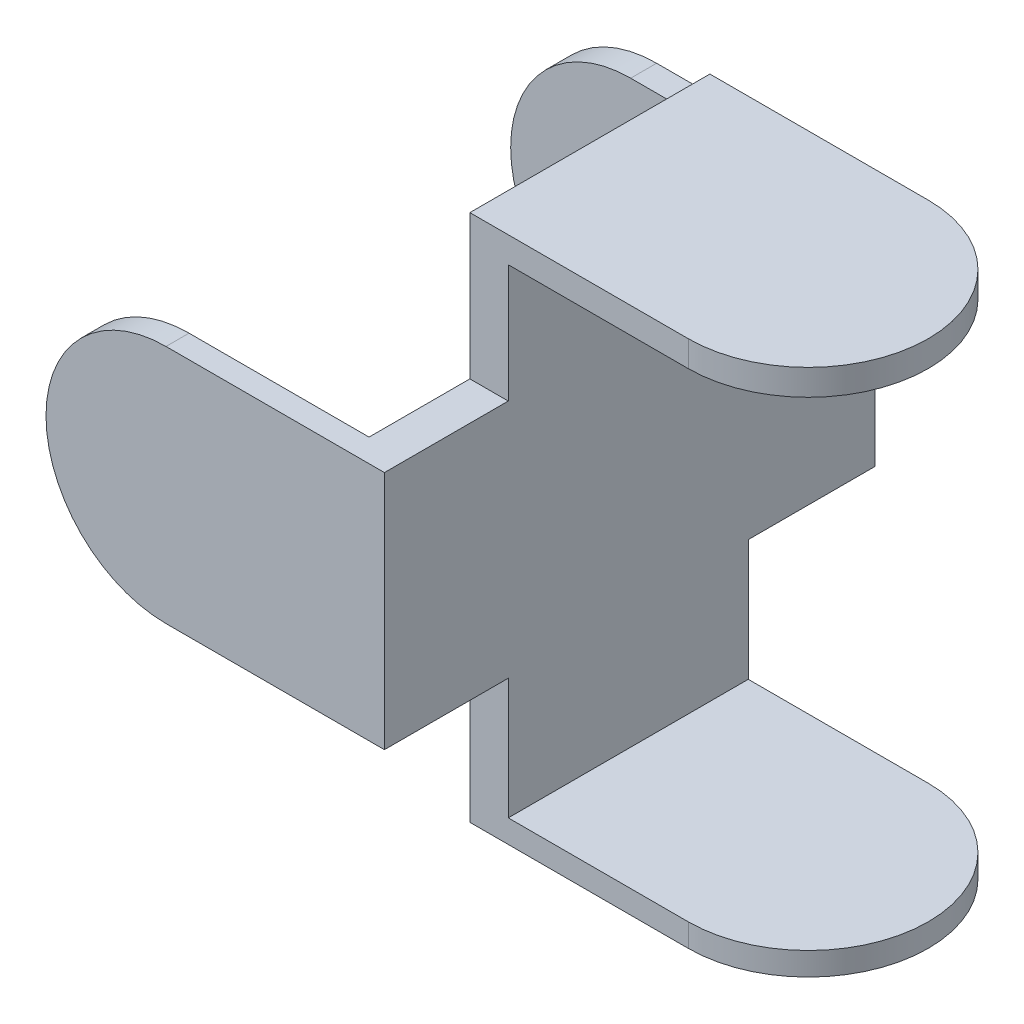
ISO-10303-21;
HEADER;
FILE_DESCRIPTION(('STEP AP214'),'2;1');
FILE_NAME('part.step','',(''),(''),'','','');
FILE_SCHEMA(('AUTOMOTIVE_DESIGN { 1 0 10303 214 1 1 1 1 }'));
ENDSEC;
DATA;
#1=APPLICATION_CONTEXT('core data for automotive mechanical design processes');
#2=APPLICATION_PROTOCOL_DEFINITION('international standard','automotive_design',2000,#1);
#3=PRODUCT_CONTEXT('',#1,'mechanical');
#4=PRODUCT('Part','Part','',(#3));
#5=PRODUCT_RELATED_PRODUCT_CATEGORY('part','',(#4));
#6=PRODUCT_DEFINITION_FORMATION('','',#4);
#7=PRODUCT_DEFINITION_CONTEXT('part definition',#1,'design');
#8=PRODUCT_DEFINITION('design','',#6,#7);
#9=PRODUCT_DEFINITION_SHAPE('','',#8);
#10=(LENGTH_UNIT() NAMED_UNIT(*) SI_UNIT(.MILLI.,.METRE.));
#11=(NAMED_UNIT(*) PLANE_ANGLE_UNIT() SI_UNIT($,.RADIAN.));
#12=(NAMED_UNIT(*) SI_UNIT($,.STERADIAN.) SOLID_ANGLE_UNIT());
#13=UNCERTAINTY_MEASURE_WITH_UNIT(LENGTH_MEASURE(1.E-05),#10,'distance_accuracy_value','');
#14=(GEOMETRIC_REPRESENTATION_CONTEXT(3) GLOBAL_UNCERTAINTY_ASSIGNED_CONTEXT((#13)) GLOBAL_UNIT_ASSIGNED_CONTEXT((#10,
#11,#12)) REPRESENTATION_CONTEXT('',''));
#15=CARTESIAN_POINT('',(0.,0.,0.));
#16=DIRECTION('',(0.,0.,1.));
#17=DIRECTION('',(1.,0.,0.));
#18=AXIS2_PLACEMENT_3D('',#15,#16,#17);
#19=CARTESIAN_POINT('',(41.5,27.5,-12.5));
#20=DIRECTION('',(0.,0.,1.));
#21=DIRECTION('',(1.,0.,0.));
#22=AXIS2_PLACEMENT_3D('',#19,#20,#21);
#23=PLANE('',#22);
#24=DIRECTION('',(1.,0.,0.));
#25=VECTOR('',#24,1.);
#26=CARTESIAN_POINT('',(22.75,-12.5,-12.5));
#27=LINE('',#26,#25);
#28=CARTESIAN_POINT('',(18.75,-12.5,-12.5));
#29=VERTEX_POINT('',#28);
#30=CARTESIAN_POINT('',(22.75,-12.5,-12.5));
#31=VERTEX_POINT('',#30);
#32=EDGE_CURVE('E67',#29,#31,#27,.T.);
#33=ORIENTED_EDGE('',*,*,#32,.T.);
#34=DIRECTION('',(0.,1.,0.));
#35=VECTOR('',#34,1.);
#36=CARTESIAN_POINT('',(22.75,-67.5195264839553,-12.5));
#37=LINE('',#36,#35);
#38=CARTESIAN_POINT('',(22.75,-25.1,-12.5));
#39=VERTEX_POINT('',#38);
#40=EDGE_CURVE('E207',#39,#31,#37,.T.);
#41=ORIENTED_EDGE('',*,*,#40,.F.);
#42=DIRECTION('',(1.,0.,0.));
#43=VECTOR('',#42,1.);
#44=CARTESIAN_POINT('',(41.5,-25.1,-12.5));
#45=LINE('',#44,#43);
#46=CARTESIAN_POINT('',(41.5,-25.1,-12.5));
#47=VERTEX_POINT('',#46);
#48=EDGE_CURVE('E351',#39,#47,#45,.T.);
#49=ORIENTED_EDGE('',*,*,#48,.T.);
#50=DIRECTION('',(0.,-1.,0.));
#51=VECTOR('',#50,1.);
#52=CARTESIAN_POINT('',(41.5,27.5,-12.5));
#53=LINE('',#52,#51);
#54=CARTESIAN_POINT('',(41.5,-27.5,-12.5));
#55=VERTEX_POINT('',#54);
#56=EDGE_CURVE('E244',#47,#55,#53,.T.);
#57=ORIENTED_EDGE('',*,*,#56,.T.);
#58=DIRECTION('',(-1.,0.,0.));
#59=VECTOR('',#58,1.);
#60=CARTESIAN_POINT('',(41.5,-27.5,-12.5));
#61=LINE('',#60,#59);
#62=CARTESIAN_POINT('',(18.75,-27.5,-12.5));
#63=VERTEX_POINT('',#62);
#64=EDGE_CURVE('E227',#55,#63,#61,.T.);
#65=ORIENTED_EDGE('',*,*,#64,.T.);
#66=DIRECTION('',(0.,-1.,0.));
#67=VECTOR('',#66,1.);
#68=CARTESIAN_POINT('',(18.75,27.5,-12.5));
#69=LINE('',#68,#67);
#70=EDGE_CURVE('E240',#29,#63,#69,.T.);
#71=ORIENTED_EDGE('',*,*,#70,.F.);
#72=EDGE_LOOP('',(#33,#41,#49,#57,#65,#71));
#73=FACE_BOUND('',#72,.T.);
#74=ADVANCED_FACE('F44',(#73),#23,.F.);
#75=CARTESIAN_POINT('',(18.75,27.5,12.5));
#76=DIRECTION('',(0.,0.,-1.));
#77=DIRECTION('',(-1.,0.,0.));
#78=AXIS2_PLACEMENT_3D('',#75,#76,#77);
#79=PLANE('',#78);
#80=DIRECTION('',(-1.,0.,0.));
#81=VECTOR('',#80,1.);
#82=CARTESIAN_POINT('',(22.75,-25.1,12.5));
#83=LINE('',#82,#81);
#84=CARTESIAN_POINT('',(41.5,-25.1,12.5));
#85=VERTEX_POINT('',#84);
#86=CARTESIAN_POINT('',(22.75,-25.1,12.5));
#87=VERTEX_POINT('',#86);
#88=EDGE_CURVE('E209',#85,#87,#83,.T.);
#89=ORIENTED_EDGE('',*,*,#88,.T.);
#90=DIRECTION('',(0.,1.,0.));
#91=VECTOR('',#90,1.);
#92=CARTESIAN_POINT('',(22.75,-67.5195264839553,12.5));
#93=LINE('',#92,#91);
#94=CARTESIAN_POINT('',(22.75,-12.5,12.5));
#95=VERTEX_POINT('',#94);
#96=EDGE_CURVE('E202',#87,#95,#93,.T.);
#97=ORIENTED_EDGE('',*,*,#96,.T.);
#98=DIRECTION('',(-1.,0.,0.));
#99=VECTOR('',#98,1.);
#100=CARTESIAN_POINT('',(22.75,-12.5,12.5));
#101=LINE('',#100,#99);
#102=CARTESIAN_POINT('',(18.75,-12.5,12.5));
#103=VERTEX_POINT('',#102);
#104=EDGE_CURVE('E248',#95,#103,#101,.T.);
#105=ORIENTED_EDGE('',*,*,#104,.T.);
#106=DIRECTION('',(0.,-1.,0.));
#107=VECTOR('',#106,1.);
#108=CARTESIAN_POINT('',(18.75,27.5,12.5));
#109=LINE('',#108,#107);
#110=CARTESIAN_POINT('',(18.75,-27.5,12.5));
#111=VERTEX_POINT('',#110);
#112=EDGE_CURVE('E237',#103,#111,#109,.T.);
#113=ORIENTED_EDGE('',*,*,#112,.T.);
#114=DIRECTION('',(1.,0.,0.));
#115=VECTOR('',#114,1.);
#116=CARTESIAN_POINT('',(18.75,-27.5,12.5));
#117=LINE('',#116,#115);
#118=CARTESIAN_POINT('',(41.5,-27.5,12.5));
#119=VERTEX_POINT('',#118);
#120=EDGE_CURVE('E218',#111,#119,#117,.T.);
#121=ORIENTED_EDGE('',*,*,#120,.T.);
#122=DIRECTION('',(0.,-1.,0.));
#123=VECTOR('',#122,1.);
#124=CARTESIAN_POINT('',(41.5,27.5,12.5));
#125=LINE('',#124,#123);
#126=EDGE_CURVE('E224',#85,#119,#125,.T.);
#127=ORIENTED_EDGE('',*,*,#126,.F.);
#128=EDGE_LOOP('',(#89,#97,#105,#113,#121,#127));
#129=FACE_BOUND('',#128,.T.);
#130=ADVANCED_FACE('F345',(#129),#79,.F.);
#131=CARTESIAN_POINT('',(41.5,27.5,0.));
#132=DIRECTION('',(0.,-1.,0.));
#133=DIRECTION('',(0.,0.,-1.));
#134=AXIS2_PLACEMENT_3D('',#131,#132,#133);
#135=CYLINDRICAL_SURFACE('',#134,12.5);
#136=CARTESIAN_POINT('',(41.5,-25.1,0.));
#137=DIRECTION('',(0.,1.,0.));
#138=DIRECTION('',(0.,0.,1.));
#139=AXIS2_PLACEMENT_3D('',#136,#137,#138);
#140=CIRCLE('',#139,12.5);
#141=EDGE_CURVE('E355',#47,#85,#140,.F.);
#142=ORIENTED_EDGE('',*,*,#141,.T.);
#143=ORIENTED_EDGE('',*,*,#126,.T.);
#144=CARTESIAN_POINT('',(41.5,-27.5,0.));
#145=DIRECTION('',(0.,1.,0.));
#146=DIRECTION('',(0.,0.,1.));
#147=AXIS2_PLACEMENT_3D('',#144,#145,#146);
#148=CIRCLE('',#147,12.5);
#149=EDGE_CURVE('E212',#119,#55,#148,.T.);
#150=ORIENTED_EDGE('',*,*,#149,.T.);
#151=ORIENTED_EDGE('',*,*,#56,.F.);
#152=EDGE_LOOP('',(#142,#143,#150,#151));
#153=FACE_BOUND('',#152,.T.);
#154=ADVANCED_FACE('F394',(#153),#135,.T.);
#155=CARTESIAN_POINT('',(0.,12.5,-25.7));
#156=DIRECTION('',(0.,-1.,0.));
#157=DIRECTION('',(1.,0.,0.));
#158=AXIS2_PLACEMENT_3D('',#155,#156,#157);
#159=PLANE('',#158);
#160=DIRECTION('',(-1.,0.,0.));
#161=VECTOR('',#160,1.);
#162=CARTESIAN_POINT('',(0.,12.5,-12.5));
#163=LINE('',#162,#161);
#164=CARTESIAN_POINT('',(22.75,12.5,-12.5));
#165=VERTEX_POINT('',#164);
#166=CARTESIAN_POINT('',(18.75,12.5,-12.5));
#167=VERTEX_POINT('',#166);
#168=EDGE_CURVE('E253',#165,#167,#163,.T.);
#169=ORIENTED_EDGE('',*,*,#168,.F.);
#170=DIRECTION('',(0.,0.,1.));
#171=VECTOR('',#170,1.);
#172=CARTESIAN_POINT('',(22.75,12.5,-25.7));
#173=LINE('',#172,#171);
#174=CARTESIAN_POINT('',(22.75,12.5,-25.7));
#175=VERTEX_POINT('',#174);
#176=EDGE_CURVE('E12',#175,#165,#173,.T.);
#177=ORIENTED_EDGE('',*,*,#176,.F.);
#178=DIRECTION('',(1.,0.,0.));
#179=VECTOR('',#178,1.);
#180=CARTESIAN_POINT('',(0.,12.5,-25.7));
#181=LINE('',#180,#179);
#182=CARTESIAN_POINT('',(0.,12.5,-25.7));
#183=VERTEX_POINT('',#182);
#184=EDGE_CURVE('E296',#183,#175,#181,.T.);
#185=ORIENTED_EDGE('',*,*,#184,.F.);
#186=DIRECTION('',(0.,0.,1.));
#187=VECTOR('',#186,1.);
#188=CARTESIAN_POINT('',(0.,12.5,-25.7));
#189=LINE('',#188,#187);
#190=CARTESIAN_POINT('',(0.,12.5,-23.));
#191=VERTEX_POINT('',#190);
#192=EDGE_CURVE('E307',#183,#191,#189,.T.);
#193=ORIENTED_EDGE('',*,*,#192,.T.);
#194=DIRECTION('',(-1.,0.,0.));
#195=VECTOR('',#194,1.);
#196=CARTESIAN_POINT('',(0.,12.5,-23.));
#197=LINE('',#196,#195);
#198=CARTESIAN_POINT('',(18.75,12.5,-23.));
#199=VERTEX_POINT('',#198);
#200=EDGE_CURVE('E256',#199,#191,#197,.T.);
#201=ORIENTED_EDGE('',*,*,#200,.F.);
#202=DIRECTION('',(0.,0.,-1.));
#203=VECTOR('',#202,1.);
#204=CARTESIAN_POINT('',(18.75,12.5,65.4195264839553));
#205=LINE('',#204,#203);
#206=EDGE_CURVE('E277',#167,#199,#205,.T.);
#207=ORIENTED_EDGE('',*,*,#206,.F.);
#208=EDGE_LOOP('',(#169,#177,#185,#193,#201,#207));
#209=FACE_BOUND('',#208,.T.);
#210=ADVANCED_FACE('F46',(#209),#159,.F.);
#211=DIRECTION('',(1.,0.,0.));
#212=VECTOR('',#211,1.);
#213=CARTESIAN_POINT('',(0.,12.5,12.5));
#214=LINE('',#213,#212);
#215=CARTESIAN_POINT('',(18.75,12.5,12.5));
#216=VERTEX_POINT('',#215);
#217=CARTESIAN_POINT('',(22.75,12.5,12.5));
#218=VERTEX_POINT('',#217);
#219=EDGE_CURVE('E201',#216,#218,#214,.T.);
#220=ORIENTED_EDGE('',*,*,#219,.F.);
#221=CARTESIAN_POINT('',(18.75,12.5,23.));
#222=VERTEX_POINT('',#221);
#223=EDGE_CURVE('E274',#222,#216,#205,.T.);
#224=ORIENTED_EDGE('',*,*,#223,.F.);
#225=DIRECTION('',(1.,0.,0.));
#226=VECTOR('',#225,1.);
#227=CARTESIAN_POINT('',(0.,12.5,23.));
#228=LINE('',#227,#226);
#229=CARTESIAN_POINT('',(0.,12.5,23.));
#230=VERTEX_POINT('',#229);
#231=EDGE_CURVE('E270',#230,#222,#228,.T.);
#232=ORIENTED_EDGE('',*,*,#231,.F.);
#233=CARTESIAN_POINT('',(0.,12.5,25.4));
#234=VERTEX_POINT('',#233);
#235=EDGE_CURVE('E306',#230,#234,#189,.T.);
#236=ORIENTED_EDGE('',*,*,#235,.T.);
#237=DIRECTION('',(1.,0.,0.));
#238=VECTOR('',#237,1.);
#239=CARTESIAN_POINT('',(0.,12.5,25.4));
#240=LINE('',#239,#238);
#241=CARTESIAN_POINT('',(22.75,12.5,25.4));
#242=VERTEX_POINT('',#241);
#243=EDGE_CURVE('E284',#234,#242,#240,.T.);
#244=ORIENTED_EDGE('',*,*,#243,.T.);
#245=EDGE_CURVE('E52',#218,#242,#173,.T.);
#246=ORIENTED_EDGE('',*,*,#245,.F.);
#247=EDGE_LOOP('',(#220,#224,#232,#236,#244,#246));
#248=FACE_BOUND('',#247,.T.);
#249=ADVANCED_FACE('F329',(#248),#159,.F.);
#250=CARTESIAN_POINT('',(22.75,12.5,-25.7));
#251=DIRECTION('',(-1.,0.,0.));
#252=DIRECTION('',(0.,0.,1.));
#253=AXIS2_PLACEMENT_3D('',#250,#251,#252);
#254=PLANE('',#253);
#255=DIRECTION('',(0.,0.,1.));
#256=VECTOR('',#255,1.);
#257=CARTESIAN_POINT('',(22.75,-12.5,-25.7));
#258=LINE('',#257,#256);
#259=CARTESIAN_POINT('',(22.75,-12.5,25.4));
#260=VERTEX_POINT('',#259);
#261=EDGE_CURVE('E313',#95,#260,#258,.T.);
#262=ORIENTED_EDGE('',*,*,#261,.F.);
#263=ORIENTED_EDGE('',*,*,#96,.F.);
#264=DIRECTION('',(0.,0.,-1.));
#265=VECTOR('',#264,1.);
#266=CARTESIAN_POINT('',(22.75,-25.1,-12.5));
#267=LINE('',#266,#265);
#268=EDGE_CURVE('E213',#87,#39,#267,.T.);
#269=ORIENTED_EDGE('',*,*,#268,.T.);
#270=ORIENTED_EDGE('',*,*,#40,.T.);
#271=CARTESIAN_POINT('',(22.75,-12.5,-25.7));
#272=VERTEX_POINT('',#271);
#273=EDGE_CURVE('E314',#272,#31,#258,.T.);
#274=ORIENTED_EDGE('',*,*,#273,.F.);
#275=DIRECTION('',(0.,-1.,0.));
#276=VECTOR('',#275,1.);
#277=CARTESIAN_POINT('',(22.75,12.5,-25.7));
#278=LINE('',#277,#276);
#279=EDGE_CURVE('E299',#175,#272,#278,.T.);
#280=ORIENTED_EDGE('',*,*,#279,.F.);
#281=ORIENTED_EDGE('',*,*,#176,.T.);
#282=CARTESIAN_POINT('',(22.75,24.8,-12.5));
#283=VERTEX_POINT('',#282);
#284=EDGE_CURVE('E196',#165,#283,#37,.T.);
#285=ORIENTED_EDGE('',*,*,#284,.T.);
#286=DIRECTION('',(0.,0.,1.));
#287=VECTOR('',#286,1.);
#288=CARTESIAN_POINT('',(22.75,24.8,-12.5));
#289=LINE('',#288,#287);
#290=CARTESIAN_POINT('',(22.75,24.8,12.5));
#291=VERTEX_POINT('',#290);
#292=EDGE_CURVE('E184',#283,#291,#289,.T.);
#293=ORIENTED_EDGE('',*,*,#292,.T.);
#294=EDGE_CURVE('E194',#218,#291,#93,.T.);
#295=ORIENTED_EDGE('',*,*,#294,.F.);
#296=ORIENTED_EDGE('',*,*,#245,.T.);
#297=DIRECTION('',(0.,-1.,0.));
#298=VECTOR('',#297,1.);
#299=CARTESIAN_POINT('',(22.75,12.5,25.4));
#300=LINE('',#299,#298);
#301=EDGE_CURVE('E287',#242,#260,#300,.T.);
#302=ORIENTED_EDGE('',*,*,#301,.T.);
#303=EDGE_LOOP('',(#262,#263,#269,#270,#274,#280,#281,#285,#293,#295,#296,#302));
#304=FACE_BOUND('',#303,.T.);
#305=ADVANCED_FACE('F193',(#304),#254,.F.);
#306=CARTESIAN_POINT('',(22.75,-12.5,-25.7));
#307=DIRECTION('',(0.,1.,0.));
#308=DIRECTION('',(-1.,0.,0.));
#309=AXIS2_PLACEMENT_3D('',#306,#307,#308);
#310=PLANE('',#309);
#311=ORIENTED_EDGE('',*,*,#32,.F.);
#312=DIRECTION('',(0.,0.,-1.));
#313=VECTOR('',#312,1.);
#314=CARTESIAN_POINT('',(18.75,-12.5,65.4195264839553));
#315=LINE('',#314,#313);
#316=CARTESIAN_POINT('',(18.75,-12.5,-23.));
#317=VERTEX_POINT('',#316);
#318=EDGE_CURVE('E273',#29,#317,#315,.T.);
#319=ORIENTED_EDGE('',*,*,#318,.T.);
#320=DIRECTION('',(1.,0.,0.));
#321=VECTOR('',#320,1.);
#322=CARTESIAN_POINT('',(18.75,-12.5,-23.));
#323=LINE('',#322,#321);
#324=CARTESIAN_POINT('',(0.,-12.5,-23.));
#325=VERTEX_POINT('',#324);
#326=EDGE_CURVE('E260',#325,#317,#323,.T.);
#327=ORIENTED_EDGE('',*,*,#326,.F.);
#328=DIRECTION('',(0.,0.,1.));
#329=VECTOR('',#328,1.);
#330=CARTESIAN_POINT('',(0.,-12.5,-25.7));
#331=LINE('',#330,#329);
#332=CARTESIAN_POINT('',(0.,-12.5,-25.7));
#333=VERTEX_POINT('',#332);
#334=EDGE_CURVE('E311',#333,#325,#331,.T.);
#335=ORIENTED_EDGE('',*,*,#334,.F.);
#336=DIRECTION('',(-1.,0.,0.));
#337=VECTOR('',#336,1.);
#338=CARTESIAN_POINT('',(22.75,-12.5,-25.7));
#339=LINE('',#338,#337);
#340=EDGE_CURVE('E301',#272,#333,#339,.T.);
#341=ORIENTED_EDGE('',*,*,#340,.F.);
#342=ORIENTED_EDGE('',*,*,#273,.T.);
#343=EDGE_LOOP('',(#311,#319,#327,#335,#341,#342));
#344=FACE_BOUND('',#343,.T.);
#345=ADVANCED_FACE('F390',(#344),#310,.F.);
#346=ORIENTED_EDGE('',*,*,#104,.F.);
#347=ORIENTED_EDGE('',*,*,#261,.T.);
#348=DIRECTION('',(-1.,0.,0.));
#349=VECTOR('',#348,1.);
#350=CARTESIAN_POINT('',(22.75,-12.5,25.4));
#351=LINE('',#350,#349);
#352=CARTESIAN_POINT('',(0.,-12.5,25.4));
#353=VERTEX_POINT('',#352);
#354=EDGE_CURVE('E290',#260,#353,#351,.T.);
#355=ORIENTED_EDGE('',*,*,#354,.T.);
#356=CARTESIAN_POINT('',(0.,-12.5,23.));
#357=VERTEX_POINT('',#356);
#358=EDGE_CURVE('E310',#357,#353,#331,.T.);
#359=ORIENTED_EDGE('',*,*,#358,.F.);
#360=DIRECTION('',(-1.,0.,0.));
#361=VECTOR('',#360,1.);
#362=CARTESIAN_POINT('',(18.75,-12.5,23.));
#363=LINE('',#362,#361);
#364=CARTESIAN_POINT('',(18.75,-12.5,23.));
#365=VERTEX_POINT('',#364);
#366=EDGE_CURVE('E268',#365,#357,#363,.T.);
#367=ORIENTED_EDGE('',*,*,#366,.F.);
#368=EDGE_CURVE('E282',#365,#103,#315,.T.);
#369=ORIENTED_EDGE('',*,*,#368,.T.);
#370=EDGE_LOOP('',(#346,#347,#355,#359,#367,#369));
#371=FACE_BOUND('',#370,.T.);
#372=ADVANCED_FACE('F320',(#371),#310,.F.);
#373=CARTESIAN_POINT('',(0.,0.,-25.7));
#374=DIRECTION('',(0.,0.,1.));
#375=DIRECTION('',(1.,0.,0.));
#376=AXIS2_PLACEMENT_3D('',#373,#374,#375);
#377=CYLINDRICAL_SURFACE('',#376,12.5);
#378=ORIENTED_EDGE('',*,*,#334,.T.);
#379=CARTESIAN_POINT('',(0.,0.,-23.));
#380=DIRECTION('',(0.,0.,1.));
#381=DIRECTION('',(1.,0.,0.));
#382=AXIS2_PLACEMENT_3D('',#379,#380,#381);
#383=CIRCLE('',#382,12.5);
#384=EDGE_CURVE('E257',#325,#191,#383,.F.);
#385=ORIENTED_EDGE('',*,*,#384,.T.);
#386=ORIENTED_EDGE('',*,*,#192,.F.);
#387=CARTESIAN_POINT('',(0.,0.,-25.7));
#388=DIRECTION('',(0.,0.,1.));
#389=DIRECTION('',(1.,0.,0.));
#390=AXIS2_PLACEMENT_3D('',#387,#388,#389);
#391=CIRCLE('',#390,12.5);
#392=EDGE_CURVE('E303',#183,#333,#391,.T.);
#393=ORIENTED_EDGE('',*,*,#392,.T.);
#394=EDGE_LOOP('',(#378,#385,#386,#393));
#395=FACE_BOUND('',#394,.T.);
#396=ADVANCED_FACE('F385',(#395),#377,.T.);
#397=CARTESIAN_POINT('',(0.,0.,23.));
#398=DIRECTION('',(0.,0.,1.));
#399=DIRECTION('',(1.,0.,0.));
#400=AXIS2_PLACEMENT_3D('',#397,#398,#399);
#401=CIRCLE('',#400,12.5);
#402=EDGE_CURVE('E266',#230,#357,#401,.T.);
#403=ORIENTED_EDGE('',*,*,#402,.T.);
#404=ORIENTED_EDGE('',*,*,#358,.T.);
#405=CARTESIAN_POINT('',(0.,0.,25.4));
#406=DIRECTION('',(0.,0.,1.));
#407=DIRECTION('',(1.,0.,0.));
#408=AXIS2_PLACEMENT_3D('',#405,#406,#407);
#409=CIRCLE('',#408,12.5);
#410=EDGE_CURVE('E293',#234,#353,#409,.T.);
#411=ORIENTED_EDGE('',*,*,#410,.F.);
#412=ORIENTED_EDGE('',*,*,#235,.F.);
#413=EDGE_LOOP('',(#403,#404,#411,#412));
#414=FACE_BOUND('',#413,.T.);
#415=ADVANCED_FACE('F334',(#414),#377,.T.);
#416=CARTESIAN_POINT('',(0.,0.,-25.7));
#417=DIRECTION('',(0.,0.,1.));
#418=DIRECTION('',(1.,0.,0.));
#419=AXIS2_PLACEMENT_3D('',#416,#417,#418);
#420=PLANE('',#419);
#421=ORIENTED_EDGE('',*,*,#184,.T.);
#422=ORIENTED_EDGE('',*,*,#279,.T.);
#423=ORIENTED_EDGE('',*,*,#340,.T.);
#424=ORIENTED_EDGE('',*,*,#392,.F.);
#425=EDGE_LOOP('',(#421,#422,#423,#424));
#426=FACE_BOUND('',#425,.T.);
#427=ADVANCED_FACE('F383',(#426),#420,.F.);
#428=CARTESIAN_POINT('',(0.,0.,25.4));
#429=DIRECTION('',(0.,0.,1.));
#430=DIRECTION('',(1.,0.,0.));
#431=AXIS2_PLACEMENT_3D('',#428,#429,#430);
#432=PLANE('',#431);
#433=ORIENTED_EDGE('',*,*,#243,.F.);
#434=ORIENTED_EDGE('',*,*,#410,.T.);
#435=ORIENTED_EDGE('',*,*,#354,.F.);
#436=ORIENTED_EDGE('',*,*,#301,.F.);
#437=EDGE_LOOP('',(#433,#434,#435,#436));
#438=FACE_BOUND('',#437,.T.);
#439=ADVANCED_FACE('F326',(#438),#432,.T.);
#440=CARTESIAN_POINT('',(0.,0.,23.));
#441=DIRECTION('',(0.,0.,1.));
#442=DIRECTION('',(1.,0.,0.));
#443=AXIS2_PLACEMENT_3D('',#440,#441,#442);
#444=PLANE('',#443);
#445=DIRECTION('',(0.,-1.,0.));
#446=VECTOR('',#445,1.);
#447=CARTESIAN_POINT('',(18.75,12.5,23.));
#448=LINE('',#447,#446);
#449=EDGE_CURVE('E271',#222,#365,#448,.T.);
#450=ORIENTED_EDGE('',*,*,#449,.T.);
#451=ORIENTED_EDGE('',*,*,#366,.T.);
#452=ORIENTED_EDGE('',*,*,#402,.F.);
#453=ORIENTED_EDGE('',*,*,#231,.T.);
#454=EDGE_LOOP('',(#450,#451,#452,#453));
#455=FACE_BOUND('',#454,.T.);
#456=ADVANCED_FACE('F338',(#455),#444,.F.);
#457=CARTESIAN_POINT('',(18.75,12.5,65.4195264839553));
#458=DIRECTION('',(1.,0.,0.));
#459=DIRECTION('',(0.,1.,0.));
#460=AXIS2_PLACEMENT_3D('',#457,#458,#459);
#461=PLANE('',#460);
#462=ORIENTED_EDGE('',*,*,#223,.T.);
#463=CARTESIAN_POINT('',(18.75,27.5,12.5));
#464=VERTEX_POINT('',#463);
#465=EDGE_CURVE('E238',#464,#216,#109,.T.);
#466=ORIENTED_EDGE('',*,*,#465,.F.);
#467=DIRECTION('',(0.,0.,1.));
#468=VECTOR('',#467,1.);
#469=CARTESIAN_POINT('',(18.75,27.5,-12.5));
#470=LINE('',#469,#468);
#471=CARTESIAN_POINT('',(18.75,27.5,-12.5));
#472=VERTEX_POINT('',#471);
#473=EDGE_CURVE('E220',#472,#464,#470,.T.);
#474=ORIENTED_EDGE('',*,*,#473,.F.);
#475=EDGE_CURVE('E241',#472,#167,#69,.T.);
#476=ORIENTED_EDGE('',*,*,#475,.T.);
#477=ORIENTED_EDGE('',*,*,#206,.T.);
#478=DIRECTION('',(0.,1.,0.));
#479=VECTOR('',#478,1.);
#480=CARTESIAN_POINT('',(18.75,12.5,-23.));
#481=LINE('',#480,#479);
#482=EDGE_CURVE('E263',#317,#199,#481,.T.);
#483=ORIENTED_EDGE('',*,*,#482,.F.);
#484=ORIENTED_EDGE('',*,*,#318,.F.);
#485=ORIENTED_EDGE('',*,*,#70,.T.);
#486=DIRECTION('',(0.,0.,1.));
#487=VECTOR('',#486,1.);
#488=CARTESIAN_POINT('',(18.75,-27.5,-12.5));
#489=LINE('',#488,#487);
#490=EDGE_CURVE('E230',#63,#111,#489,.T.);
#491=ORIENTED_EDGE('',*,*,#490,.T.);
#492=ORIENTED_EDGE('',*,*,#112,.F.);
#493=ORIENTED_EDGE('',*,*,#368,.F.);
#494=ORIENTED_EDGE('',*,*,#449,.F.);
#495=EDGE_LOOP('',(#462,#466,#474,#476,#477,#483,#484,#485,#491,#492,#493,#494));
#496=FACE_BOUND('',#495,.T.);
#497=ADVANCED_FACE('F341',(#496),#461,.F.);
#498=CARTESIAN_POINT('',(0.,0.,-23.));
#499=DIRECTION('',(0.,0.,1.));
#500=DIRECTION('',(1.,0.,0.));
#501=AXIS2_PLACEMENT_3D('',#498,#499,#500);
#502=PLANE('',#501);
#503=ORIENTED_EDGE('',*,*,#326,.T.);
#504=ORIENTED_EDGE('',*,*,#482,.T.);
#505=ORIENTED_EDGE('',*,*,#200,.T.);
#506=ORIENTED_EDGE('',*,*,#384,.F.);
#507=EDGE_LOOP('',(#503,#504,#505,#506));
#508=FACE_BOUND('',#507,.T.);
#509=ADVANCED_FACE('F389',(#508),#502,.T.);
#510=DIRECTION('',(-1.,0.,0.));
#511=VECTOR('',#510,1.);
#512=CARTESIAN_POINT('',(41.5,24.8,-12.5));
#513=LINE('',#512,#511);
#514=CARTESIAN_POINT('',(41.5,24.8,-12.5));
#515=VERTEX_POINT('',#514);
#516=EDGE_CURVE('E59',#515,#283,#513,.T.);
#517=ORIENTED_EDGE('',*,*,#516,.T.);
#518=ORIENTED_EDGE('',*,*,#284,.F.);
#519=ORIENTED_EDGE('',*,*,#168,.T.);
#520=ORIENTED_EDGE('',*,*,#475,.F.);
#521=DIRECTION('',(-1.,0.,0.));
#522=VECTOR('',#521,1.);
#523=CARTESIAN_POINT('',(41.5,27.5,-12.5));
#524=LINE('',#523,#522);
#525=CARTESIAN_POINT('',(41.5,27.5,-12.5));
#526=VERTEX_POINT('',#525);
#527=EDGE_CURVE('E217',#526,#472,#524,.T.);
#528=ORIENTED_EDGE('',*,*,#527,.F.);
#529=EDGE_CURVE('E245',#526,#515,#53,.T.);
#530=ORIENTED_EDGE('',*,*,#529,.T.);
#531=EDGE_LOOP('',(#517,#518,#519,#520,#528,#530));
#532=FACE_BOUND('',#531,.T.);
#533=ADVANCED_FACE('F364',(#532),#23,.F.);
#534=ORIENTED_EDGE('',*,*,#219,.T.);
#535=ORIENTED_EDGE('',*,*,#294,.T.);
#536=DIRECTION('',(1.,0.,0.));
#537=VECTOR('',#536,1.);
#538=CARTESIAN_POINT('',(22.75,24.8,12.5));
#539=LINE('',#538,#537);
#540=CARTESIAN_POINT('',(41.5,24.8,12.5));
#541=VERTEX_POINT('',#540);
#542=EDGE_CURVE('E181',#291,#541,#539,.T.);
#543=ORIENTED_EDGE('',*,*,#542,.T.);
#544=CARTESIAN_POINT('',(41.5,27.5,12.5));
#545=VERTEX_POINT('',#544);
#546=EDGE_CURVE('E235',#545,#541,#125,.T.);
#547=ORIENTED_EDGE('',*,*,#546,.F.);
#548=DIRECTION('',(1.,0.,0.));
#549=VECTOR('',#548,1.);
#550=CARTESIAN_POINT('',(18.75,27.5,12.5));
#551=LINE('',#550,#549);
#552=EDGE_CURVE('E222',#464,#545,#551,.T.);
#553=ORIENTED_EDGE('',*,*,#552,.F.);
#554=ORIENTED_EDGE('',*,*,#465,.T.);
#555=EDGE_LOOP('',(#534,#535,#543,#547,#553,#554));
#556=FACE_BOUND('',#555,.T.);
#557=ADVANCED_FACE('F199',(#556),#79,.F.);
#558=ORIENTED_EDGE('',*,*,#546,.T.);
#559=CARTESIAN_POINT('',(41.5,24.8,0.));
#560=DIRECTION('',(0.,1.,0.));
#561=DIRECTION('',(0.,0.,1.));
#562=AXIS2_PLACEMENT_3D('',#559,#560,#561);
#563=CIRCLE('',#562,12.5);
#564=EDGE_CURVE('E185',#541,#515,#563,.T.);
#565=ORIENTED_EDGE('',*,*,#564,.T.);
#566=ORIENTED_EDGE('',*,*,#529,.F.);
#567=CARTESIAN_POINT('',(41.5,27.5,0.));
#568=DIRECTION('',(0.,1.,0.));
#569=DIRECTION('',(0.,0.,1.));
#570=AXIS2_PLACEMENT_3D('',#567,#568,#569);
#571=CIRCLE('',#570,12.5);
#572=EDGE_CURVE('E214',#545,#526,#571,.T.);
#573=ORIENTED_EDGE('',*,*,#572,.F.);
#574=EDGE_LOOP('',(#558,#565,#566,#573));
#575=FACE_BOUND('',#574,.T.);
#576=ADVANCED_FACE('F370',(#575),#135,.T.);
#577=CARTESIAN_POINT('',(41.5,27.5,0.));
#578=DIRECTION('',(0.,1.,0.));
#579=DIRECTION('',(0.,0.,1.));
#580=AXIS2_PLACEMENT_3D('',#577,#578,#579);
#581=PLANE('',#580);
#582=ORIENTED_EDGE('',*,*,#572,.T.);
#583=ORIENTED_EDGE('',*,*,#527,.T.);
#584=ORIENTED_EDGE('',*,*,#473,.T.);
#585=ORIENTED_EDGE('',*,*,#552,.T.);
#586=EDGE_LOOP('',(#582,#583,#584,#585));
#587=FACE_BOUND('',#586,.T.);
#588=ADVANCED_FACE('F374',(#587),#581,.T.);
#589=CARTESIAN_POINT('',(41.5,-27.5,0.));
#590=DIRECTION('',(0.,1.,0.));
#591=DIRECTION('',(0.,0.,1.));
#592=AXIS2_PLACEMENT_3D('',#589,#590,#591);
#593=PLANE('',#592);
#594=ORIENTED_EDGE('',*,*,#149,.F.);
#595=ORIENTED_EDGE('',*,*,#120,.F.);
#596=ORIENTED_EDGE('',*,*,#490,.F.);
#597=ORIENTED_EDGE('',*,*,#64,.F.);
#598=EDGE_LOOP('',(#594,#595,#596,#597));
#599=FACE_BOUND('',#598,.T.);
#600=ADVANCED_FACE('F393',(#599),#593,.F.);
#601=CARTESIAN_POINT('',(41.5,-25.1,0.));
#602=DIRECTION('',(0.,1.,0.));
#603=DIRECTION('',(0.,0.,1.));
#604=AXIS2_PLACEMENT_3D('',#601,#602,#603);
#605=PLANE('',#604);
#606=ORIENTED_EDGE('',*,*,#268,.F.);
#607=ORIENTED_EDGE('',*,*,#88,.F.);
#608=ORIENTED_EDGE('',*,*,#141,.F.);
#609=ORIENTED_EDGE('',*,*,#48,.F.);
#610=EDGE_LOOP('',(#606,#607,#608,#609));
#611=FACE_BOUND('',#610,.T.);
#612=ADVANCED_FACE('F353',(#611),#605,.T.);
#613=CARTESIAN_POINT('',(41.5,24.8,0.));
#614=DIRECTION('',(0.,1.,0.));
#615=DIRECTION('',(0.,0.,1.));
#616=AXIS2_PLACEMENT_3D('',#613,#614,#615);
#617=PLANE('',#616);
#618=ORIENTED_EDGE('',*,*,#516,.F.);
#619=ORIENTED_EDGE('',*,*,#564,.F.);
#620=ORIENTED_EDGE('',*,*,#542,.F.);
#621=ORIENTED_EDGE('',*,*,#292,.F.);
#622=EDGE_LOOP('',(#618,#619,#620,#621));
#623=FACE_BOUND('',#622,.T.);
#624=ADVANCED_FACE('F183',(#623),#617,.F.);
#625=CLOSED_SHELL('',(#74,#130,#154,#210,#249,#305,#345,#372,#396,#415,#427,#439,#456,#497,#509,
#533,#557,#576,#588,#600,#612,#624));
#626=MANIFOLD_SOLID_BREP('B2',#625);
#627=ADVANCED_BREP_SHAPE_REPRESENTATION('',(#18,#626),#14);
#628=SHAPE_DEFINITION_REPRESENTATION(#9,#627);
ENDSEC;
END-ISO-10303-21;
